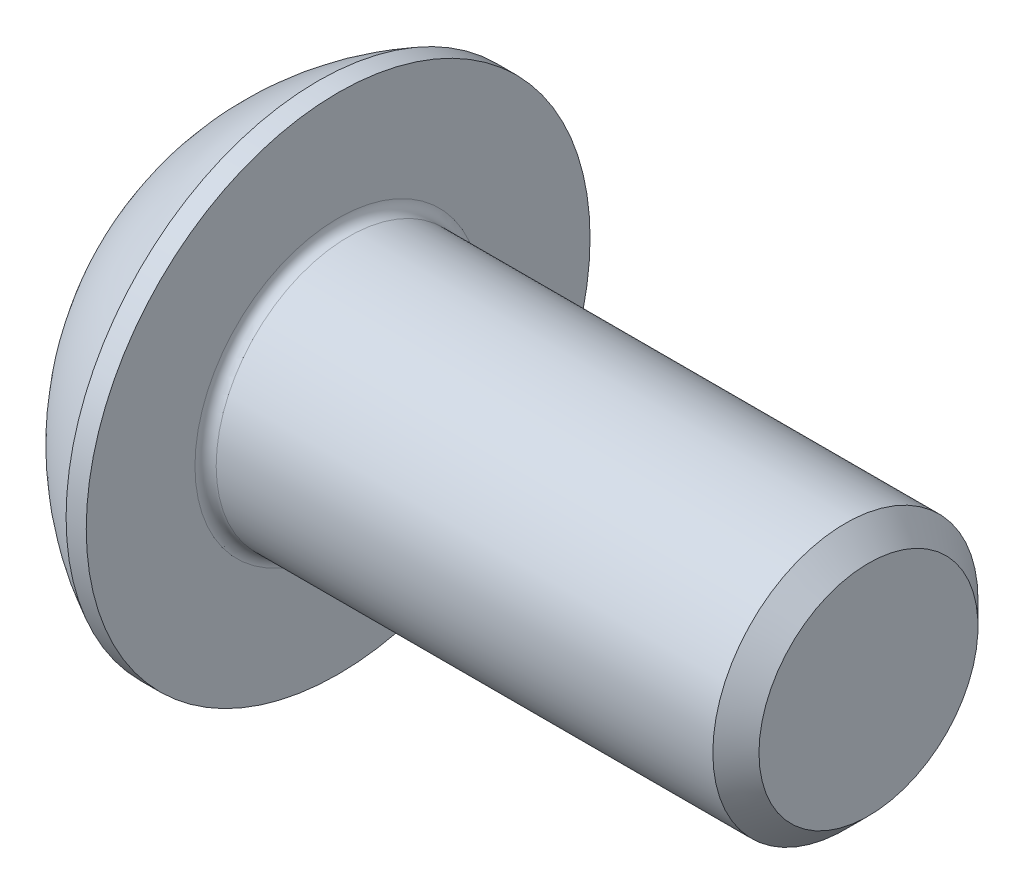
ISO-10303-21;
HEADER;
FILE_DESCRIPTION(('STEP AP214'),'2;1');
FILE_NAME('part.step','',(''),(''),'','','');
FILE_SCHEMA(('AUTOMOTIVE_DESIGN { 1 0 10303 214 1 1 1 1 }'));
ENDSEC;
DATA;
#1=APPLICATION_CONTEXT('core data for automotive mechanical design processes');
#2=APPLICATION_PROTOCOL_DEFINITION('international standard','automotive_design',2000,#1);
#3=PRODUCT_CONTEXT('',#1,'mechanical');
#4=PRODUCT('Part','Part','',(#3));
#5=PRODUCT_RELATED_PRODUCT_CATEGORY('part','',(#4));
#6=PRODUCT_DEFINITION_FORMATION('','',#4);
#7=PRODUCT_DEFINITION_CONTEXT('part definition',#1,'design');
#8=PRODUCT_DEFINITION('design','',#6,#7);
#9=PRODUCT_DEFINITION_SHAPE('','',#8);
#10=(LENGTH_UNIT() NAMED_UNIT(*) SI_UNIT(.MILLI.,.METRE.));
#11=(NAMED_UNIT(*) PLANE_ANGLE_UNIT() SI_UNIT($,.RADIAN.));
#12=(NAMED_UNIT(*) SI_UNIT($,.STERADIAN.) SOLID_ANGLE_UNIT());
#13=UNCERTAINTY_MEASURE_WITH_UNIT(LENGTH_MEASURE(1.E-05),#10,'distance_accuracy_value','');
#14=(GEOMETRIC_REPRESENTATION_CONTEXT(3) GLOBAL_UNCERTAINTY_ASSIGNED_CONTEXT((#13)) GLOBAL_UNIT_ASSIGNED_CONTEXT((#10,
#11,#12)) REPRESENTATION_CONTEXT('',''));
#15=CARTESIAN_POINT('',(0.,0.,0.));
#16=DIRECTION('',(0.,0.,1.));
#17=DIRECTION('',(1.,0.,0.));
#18=AXIS2_PLACEMENT_3D('',#15,#16,#17);
#19=CARTESIAN_POINT('',(0.,0.,0.));
#20=DIRECTION('',(-1.,0.,0.));
#21=DIRECTION('',(0.,0.,1.));
#22=AXIS2_PLACEMENT_3D('',#19,#20,#21);
#23=PLANE('',#22);
#24=CARTESIAN_POINT('',(0.,0.,0.));
#25=DIRECTION('',(-1.,0.,0.));
#26=DIRECTION('',(0.,0.,1.));
#27=AXIS2_PLACEMENT_3D('',#24,#25,#26);
#28=CIRCLE('',#27,2.375);
#29=CARTESIAN_POINT('',(0.,0.,2.375));
#30=VERTEX_POINT('',#29);
#31=EDGE_CURVE('E128',#30,#30,#28,.T.);
#32=ORIENTED_EDGE('',*,*,#31,.T.);
#33=EDGE_LOOP('',(#32));
#34=FACE_BOUND('',#33,.T.);
#35=DIRECTION('',(0.,-1.,0.));
#36=VECTOR('',#35,1.);
#37=CARTESIAN_POINT('',(0.,-0.866025403784438,1.5));
#38=LINE('',#37,#36);
#39=CARTESIAN_POINT('',(0.,0.866025403784439,1.5));
#40=VERTEX_POINT('',#39);
#41=CARTESIAN_POINT('',(0.,-0.866025403784438,1.5));
#42=VERTEX_POINT('',#41);
#43=EDGE_CURVE('E104',#40,#42,#38,.T.);
#44=ORIENTED_EDGE('',*,*,#43,.T.);
#45=DIRECTION('',(0.,-0.5,-0.866025403784439));
#46=VECTOR('',#45,1.);
#47=CARTESIAN_POINT('',(0.,-1.73205080756888,0.));
#48=LINE('',#47,#46);
#49=CARTESIAN_POINT('',(0.,-1.73205080756888,0.));
#50=VERTEX_POINT('',#49);
#51=EDGE_CURVE('E50',#42,#50,#48,.T.);
#52=ORIENTED_EDGE('',*,*,#51,.T.);
#53=DIRECTION('',(0.,0.5,-0.866025403784439));
#54=VECTOR('',#53,1.);
#55=CARTESIAN_POINT('',(0.,-0.866025403784438,-1.5));
#56=LINE('',#55,#54);
#57=CARTESIAN_POINT('',(0.,-0.866025403784438,-1.5));
#58=VERTEX_POINT('',#57);
#59=EDGE_CURVE('E108',#50,#58,#56,.T.);
#60=ORIENTED_EDGE('',*,*,#59,.T.);
#61=DIRECTION('',(0.,1.,0.));
#62=VECTOR('',#61,1.);
#63=CARTESIAN_POINT('',(0.,0.866025403784439,-1.5));
#64=LINE('',#63,#62);
#65=CARTESIAN_POINT('',(0.,0.866025403784439,-1.5));
#66=VERTEX_POINT('',#65);
#67=EDGE_CURVE('E305',#58,#66,#64,.T.);
#68=ORIENTED_EDGE('',*,*,#67,.T.);
#69=DIRECTION('',(0.,0.5,0.866025403784439));
#70=VECTOR('',#69,1.);
#71=CARTESIAN_POINT('',(0.,1.73205080756888,0.));
#72=LINE('',#71,#70);
#73=CARTESIAN_POINT('',(0.,1.73205080756888,0.));
#74=VERTEX_POINT('',#73);
#75=EDGE_CURVE('E302',#66,#74,#72,.T.);
#76=ORIENTED_EDGE('',*,*,#75,.T.);
#77=DIRECTION('',(0.,-0.5,0.866025403784439));
#78=VECTOR('',#77,1.);
#79=CARTESIAN_POINT('',(0.,0.866025403784439,1.5));
#80=LINE('',#79,#78);
#81=EDGE_CURVE('E296',#74,#40,#80,.T.);
#82=ORIENTED_EDGE('',*,*,#81,.T.);
#83=EDGE_LOOP('',(#44,#52,#60,#68,#76,#82));
#84=FACE_BOUND('',#83,.T.);
#85=ADVANCED_FACE('F34',(#34,#84),#23,.T.);
#86=CARTESIAN_POINT('',(4.75501582278481,0.,0.));
#87=DIRECTION('',(-1.,0.,0.));
#88=DIRECTION('',(0.,1.,0.));
#89=AXIS2_PLACEMENT_3D('',#86,#87,#88);
#90=SPHERICAL_SURFACE('',#89,5.3151482081814);
#91=CARTESIAN_POINT('',(2.37,0.,0.));
#92=DIRECTION('',(-1.,0.,0.));
#93=DIRECTION('',(0.,0.,1.));
#94=AXIS2_PLACEMENT_3D('',#91,#92,#93);
#95=CIRCLE('',#94,4.75);
#96=CARTESIAN_POINT('',(2.37,0.,4.75));
#97=VERTEX_POINT('',#96);
#98=EDGE_CURVE('E125',#97,#97,#95,.T.);
#99=ORIENTED_EDGE('',*,*,#98,.T.);
#100=EDGE_LOOP('',(#99));
#101=FACE_BOUND('',#100,.T.);
#102=ORIENTED_EDGE('',*,*,#31,.F.);
#103=EDGE_LOOP('',(#102));
#104=FACE_BOUND('',#103,.T.);
#105=ADVANCED_FACE('F150',(#101,#104),#90,.T.);
#106=CARTESIAN_POINT('',(0.,0.,0.));
#107=DIRECTION('',(-1.,0.,0.));
#108=DIRECTION('',(0.,0.,1.));
#109=AXIS2_PLACEMENT_3D('',#106,#107,#108);
#110=CYLINDRICAL_SURFACE('',#109,4.75);
#111=ORIENTED_EDGE('',*,*,#98,.F.);
#112=EDGE_LOOP('',(#111));
#113=FACE_BOUND('',#112,.T.);
#114=CARTESIAN_POINT('',(2.75,0.,0.));
#115=DIRECTION('',(-1.,0.,0.));
#116=DIRECTION('',(0.,0.,1.));
#117=AXIS2_PLACEMENT_3D('',#114,#115,#116);
#118=CIRCLE('',#117,4.75);
#119=CARTESIAN_POINT('',(2.75,0.,4.75));
#120=VERTEX_POINT('',#119);
#121=EDGE_CURVE('E122',#120,#120,#118,.T.);
#122=ORIENTED_EDGE('',*,*,#121,.T.);
#123=EDGE_LOOP('',(#122));
#124=FACE_BOUND('',#123,.T.);
#125=ADVANCED_FACE('F155',(#113,#124),#110,.T.);
#126=CARTESIAN_POINT('',(2.75,2.5,0.));
#127=DIRECTION('',(-1.,0.,0.));
#128=DIRECTION('',(0.,0.,1.));
#129=AXIS2_PLACEMENT_3D('',#126,#127,#128);
#130=PLANE('',#129);
#131=CARTESIAN_POINT('',(2.75,0.,0.));
#132=DIRECTION('',(-1.,0.,0.));
#133=DIRECTION('',(0.,0.,1.));
#134=AXIS2_PLACEMENT_3D('',#131,#132,#133);
#135=CIRCLE('',#134,2.7);
#136=CARTESIAN_POINT('',(2.75,0.,2.7));
#137=VERTEX_POINT('',#136);
#138=EDGE_CURVE('E43',#137,#137,#135,.T.);
#139=ORIENTED_EDGE('',*,*,#138,.T.);
#140=EDGE_LOOP('',(#139));
#141=FACE_BOUND('',#140,.T.);
#142=ORIENTED_EDGE('',*,*,#121,.F.);
#143=EDGE_LOOP('',(#142));
#144=FACE_BOUND('',#143,.T.);
#145=ADVANCED_FACE('F134',(#141,#144),#130,.F.);
#146=CARTESIAN_POINT('',(0.,0.,0.));
#147=DIRECTION('',(-1.,0.,0.));
#148=DIRECTION('',(0.,0.,1.));
#149=AXIS2_PLACEMENT_3D('',#146,#147,#148);
#150=CYLINDRICAL_SURFACE('',#149,2.5);
#151=CARTESIAN_POINT('',(2.95,0.,0.));
#152=DIRECTION('',(-1.,0.,0.));
#153=DIRECTION('',(0.,0.,1.));
#154=AXIS2_PLACEMENT_3D('',#151,#152,#153);
#155=CIRCLE('',#154,2.5);
#156=CARTESIAN_POINT('',(2.95,0.,2.5));
#157=VERTEX_POINT('',#156);
#158=EDGE_CURVE('E11',#157,#157,#155,.F.);
#159=ORIENTED_EDGE('',*,*,#158,.T.);
#160=EDGE_LOOP('',(#159));
#161=FACE_BOUND('',#160,.T.);
#162=CARTESIAN_POINT('',(12.315,0.,0.));
#163=DIRECTION('',(-1.,0.,0.));
#164=DIRECTION('',(0.,0.,1.));
#165=AXIS2_PLACEMENT_3D('',#162,#163,#164);
#166=CIRCLE('',#165,2.5);
#167=CARTESIAN_POINT('',(12.315,0.,2.5));
#168=VERTEX_POINT('',#167);
#169=EDGE_CURVE('E119',#168,#168,#166,.T.);
#170=ORIENTED_EDGE('',*,*,#169,.T.);
#171=EDGE_LOOP('',(#170));
#172=FACE_BOUND('',#171,.T.);
#173=ADVANCED_FACE('F165',(#161,#172),#150,.T.);
#174=CARTESIAN_POINT('',(12.75,0.,0.));
#175=DIRECTION('',(-1.,0.,0.));
#176=DIRECTION('',(0.,0.,1.));
#177=AXIS2_PLACEMENT_3D('',#174,#175,#176);
#178=CONICAL_SURFACE('',#177,2.065,0.785398163397443);
#179=ORIENTED_EDGE('',*,*,#169,.F.);
#180=EDGE_LOOP('',(#179));
#181=FACE_BOUND('',#180,.T.);
#182=CARTESIAN_POINT('',(12.75,0.,0.));
#183=DIRECTION('',(-1.,0.,0.));
#184=DIRECTION('',(0.,0.,1.));
#185=AXIS2_PLACEMENT_3D('',#182,#183,#184);
#186=CIRCLE('',#185,2.065);
#187=CARTESIAN_POINT('',(12.75,0.,2.065));
#188=VERTEX_POINT('',#187);
#189=EDGE_CURVE('E112',#188,#188,#186,.T.);
#190=ORIENTED_EDGE('',*,*,#189,.T.);
#191=EDGE_LOOP('',(#190));
#192=FACE_BOUND('',#191,.T.);
#193=ADVANCED_FACE('F145',(#181,#192),#178,.T.);
#194=CARTESIAN_POINT('',(12.75,0.,0.));
#195=DIRECTION('',(-1.,0.,0.));
#196=DIRECTION('',(0.,0.,1.));
#197=AXIS2_PLACEMENT_3D('',#194,#195,#196);
#198=PLANE('',#197);
#199=ORIENTED_EDGE('',*,*,#189,.F.);
#200=EDGE_LOOP('',(#199));
#201=FACE_BOUND('',#200,.T.);
#202=ADVANCED_FACE('F138',(#201),#198,.F.);
#203=CARTESIAN_POINT('',(2.95,0.,0.));
#204=DIRECTION('',(-1.,0.,0.));
#205=DIRECTION('',(0.,0.,1.));
#206=AXIS2_PLACEMENT_3D('',#203,#204,#205);
#207=TOROIDAL_SURFACE('',#206,2.7,0.2);
#208=ORIENTED_EDGE('',*,*,#158,.F.);
#209=EDGE_LOOP('',(#208));
#210=FACE_BOUND('',#209,.T.);
#211=ORIENTED_EDGE('',*,*,#138,.F.);
#212=EDGE_LOOP('',(#211));
#213=FACE_BOUND('',#212,.T.);
#214=ADVANCED_FACE('F36',(#210,#213),#207,.F.);
#215=CARTESIAN_POINT('',(1.5,-1.73205080756888,0.));
#216=DIRECTION('',(0.,0.866025403784439,-0.5));
#217=DIRECTION('',(0.,0.5,0.866025403784439));
#218=AXIS2_PLACEMENT_3D('',#215,#216,#217);
#219=PLANE('',#218);
#220=ORIENTED_EDGE('',*,*,#51,.F.);
#221=DIRECTION('',(-1.,0.,0.));
#222=VECTOR('',#221,1.);
#223=CARTESIAN_POINT('',(1.5,-0.866025403784438,1.5));
#224=LINE('',#223,#222);
#225=CARTESIAN_POINT('',(1.5,-0.866025403784438,1.5));
#226=VERTEX_POINT('',#225);
#227=EDGE_CURVE('E103',#226,#42,#224,.T.);
#228=ORIENTED_EDGE('',*,*,#227,.F.);
#229=DIRECTION('',(0.,-0.5,-0.866025403784439));
#230=VECTOR('',#229,1.);
#231=CARTESIAN_POINT('',(1.5,-1.73205080756888,0.));
#232=LINE('',#231,#230);
#233=CARTESIAN_POINT('',(1.5,-1.73205080756888,0.));
#234=VERTEX_POINT('',#233);
#235=EDGE_CURVE('E94',#226,#234,#232,.T.);
#236=ORIENTED_EDGE('',*,*,#235,.T.);
#237=DIRECTION('',(-1.,0.,0.));
#238=VECTOR('',#237,1.);
#239=CARTESIAN_POINT('',(1.5,-1.73205080756888,0.));
#240=LINE('',#239,#238);
#241=EDGE_CURVE('E102',#234,#50,#240,.T.);
#242=ORIENTED_EDGE('',*,*,#241,.T.);
#243=EDGE_LOOP('',(#220,#228,#236,#242));
#244=FACE_BOUND('',#243,.T.);
#245=ADVANCED_FACE('F101',(#244),#219,.T.);
#246=CARTESIAN_POINT('',(1.5,-0.866025403784438,-1.5));
#247=DIRECTION('',(0.,0.866025403784438,0.5));
#248=DIRECTION('',(0.,-0.5,0.866025403784439));
#249=AXIS2_PLACEMENT_3D('',#246,#247,#248);
#250=PLANE('',#249);
#251=ORIENTED_EDGE('',*,*,#59,.F.);
#252=ORIENTED_EDGE('',*,*,#241,.F.);
#253=DIRECTION('',(0.,0.5,-0.866025403784439));
#254=VECTOR('',#253,1.);
#255=CARTESIAN_POINT('',(1.5,-0.866025403784438,-1.5));
#256=LINE('',#255,#254);
#257=CARTESIAN_POINT('',(1.5,-0.866025403784438,-1.5));
#258=VERTEX_POINT('',#257);
#259=EDGE_CURVE('E90',#234,#258,#256,.T.);
#260=ORIENTED_EDGE('',*,*,#259,.T.);
#261=DIRECTION('',(-1.,0.,0.));
#262=VECTOR('',#261,1.);
#263=CARTESIAN_POINT('',(1.5,-0.866025403784438,-1.5));
#264=LINE('',#263,#262);
#265=EDGE_CURVE('E109',#258,#58,#264,.T.);
#266=ORIENTED_EDGE('',*,*,#265,.T.);
#267=EDGE_LOOP('',(#251,#252,#260,#266));
#268=FACE_BOUND('',#267,.T.);
#269=ADVANCED_FACE('F106',(#268),#250,.T.);
#270=CARTESIAN_POINT('',(1.5,0.866025403784439,-1.5));
#271=DIRECTION('',(0.,0.,1.));
#272=DIRECTION('',(1.,0.,0.));
#273=AXIS2_PLACEMENT_3D('',#270,#271,#272);
#274=PLANE('',#273);
#275=ORIENTED_EDGE('',*,*,#67,.F.);
#276=ORIENTED_EDGE('',*,*,#265,.F.);
#277=DIRECTION('',(0.,1.,0.));
#278=VECTOR('',#277,1.);
#279=CARTESIAN_POINT('',(1.5,0.866025403784439,-1.5));
#280=LINE('',#279,#278);
#281=CARTESIAN_POINT('',(1.5,0.866025403784439,-1.5));
#282=VERTEX_POINT('',#281);
#283=EDGE_CURVE('E96',#258,#282,#280,.T.);
#284=ORIENTED_EDGE('',*,*,#283,.T.);
#285=DIRECTION('',(-1.,0.,0.));
#286=VECTOR('',#285,1.);
#287=CARTESIAN_POINT('',(1.5,0.866025403784439,-1.5));
#288=LINE('',#287,#286);
#289=EDGE_CURVE('E113',#282,#66,#288,.T.);
#290=ORIENTED_EDGE('',*,*,#289,.T.);
#291=EDGE_LOOP('',(#275,#276,#284,#290));
#292=FACE_BOUND('',#291,.T.);
#293=ADVANCED_FACE('F178',(#292),#274,.T.);
#294=CARTESIAN_POINT('',(1.5,1.73205080756888,0.));
#295=DIRECTION('',(0.,-0.866025403784439,0.5));
#296=DIRECTION('',(0.,-0.5,-0.866025403784439));
#297=AXIS2_PLACEMENT_3D('',#294,#295,#296);
#298=PLANE('',#297);
#299=ORIENTED_EDGE('',*,*,#75,.F.);
#300=ORIENTED_EDGE('',*,*,#289,.F.);
#301=DIRECTION('',(0.,0.5,0.866025403784439));
#302=VECTOR('',#301,1.);
#303=CARTESIAN_POINT('',(1.5,1.73205080756888,0.));
#304=LINE('',#303,#302);
#305=CARTESIAN_POINT('',(1.5,1.73205080756888,0.));
#306=VERTEX_POINT('',#305);
#307=EDGE_CURVE('E321',#282,#306,#304,.T.);
#308=ORIENTED_EDGE('',*,*,#307,.T.);
#309=DIRECTION('',(-1.,0.,0.));
#310=VECTOR('',#309,1.);
#311=CARTESIAN_POINT('',(1.5,1.73205080756888,0.));
#312=LINE('',#311,#310);
#313=EDGE_CURVE('E312',#306,#74,#312,.T.);
#314=ORIENTED_EDGE('',*,*,#313,.T.);
#315=EDGE_LOOP('',(#299,#300,#308,#314));
#316=FACE_BOUND('',#315,.T.);
#317=ADVANCED_FACE('F181',(#316),#298,.T.);
#318=CARTESIAN_POINT('',(1.5,0.866025403784439,1.5));
#319=DIRECTION('',(0.,-0.866025403784439,-0.5));
#320=DIRECTION('',(0.,0.5,-0.866025403784439));
#321=AXIS2_PLACEMENT_3D('',#318,#319,#320);
#322=PLANE('',#321);
#323=ORIENTED_EDGE('',*,*,#81,.F.);
#324=ORIENTED_EDGE('',*,*,#313,.F.);
#325=DIRECTION('',(0.,-0.5,0.866025403784439));
#326=VECTOR('',#325,1.);
#327=CARTESIAN_POINT('',(1.5,0.866025403784439,1.5));
#328=LINE('',#327,#326);
#329=CARTESIAN_POINT('',(1.5,0.866025403784439,1.5));
#330=VERTEX_POINT('',#329);
#331=EDGE_CURVE('E319',#306,#330,#328,.T.);
#332=ORIENTED_EDGE('',*,*,#331,.T.);
#333=DIRECTION('',(-1.,0.,0.));
#334=VECTOR('',#333,1.);
#335=CARTESIAN_POINT('',(1.5,0.866025403784439,1.5));
#336=LINE('',#335,#334);
#337=EDGE_CURVE('E295',#330,#40,#336,.T.);
#338=ORIENTED_EDGE('',*,*,#337,.T.);
#339=EDGE_LOOP('',(#323,#324,#332,#338));
#340=FACE_BOUND('',#339,.T.);
#341=ADVANCED_FACE('F185',(#340),#322,.T.);
#342=CARTESIAN_POINT('',(1.5,-0.866025403784438,1.5));
#343=DIRECTION('',(0.,0.,-1.));
#344=DIRECTION('',(-1.,0.,0.));
#345=AXIS2_PLACEMENT_3D('',#342,#343,#344);
#346=PLANE('',#345);
#347=ORIENTED_EDGE('',*,*,#43,.F.);
#348=ORIENTED_EDGE('',*,*,#337,.F.);
#349=DIRECTION('',(0.,-1.,0.));
#350=VECTOR('',#349,1.);
#351=CARTESIAN_POINT('',(1.5,-0.866025403784438,1.5));
#352=LINE('',#351,#350);
#353=EDGE_CURVE('E310',#330,#226,#352,.T.);
#354=ORIENTED_EDGE('',*,*,#353,.T.);
#355=ORIENTED_EDGE('',*,*,#227,.T.);
#356=EDGE_LOOP('',(#347,#348,#354,#355));
#357=FACE_BOUND('',#356,.T.);
#358=ADVANCED_FACE('F189',(#357),#346,.T.);
#359=CARTESIAN_POINT('',(1.5,-1.73205080756888,0.));
#360=DIRECTION('',(1.,0.,0.));
#361=DIRECTION('',(0.,0.,-1.));
#362=AXIS2_PLACEMENT_3D('',#359,#360,#361);
#363=PLANE('',#362);
#364=CARTESIAN_POINT('',(1.5,0.,0.));
#365=DIRECTION('',(1.,0.,0.));
#366=DIRECTION('',(0.,0.,-1.));
#367=AXIS2_PLACEMENT_3D('',#364,#365,#366);
#368=CIRCLE('',#367,0.903589838486229);
#369=CARTESIAN_POINT('',(1.5,0.,-0.903589838486229));
#370=VERTEX_POINT('',#369);
#371=EDGE_CURVE('E38',#370,#370,#368,.T.);
#372=ORIENTED_EDGE('',*,*,#371,.T.);
#373=EDGE_LOOP('',(#372));
#374=FACE_BOUND('',#373,.T.);
#375=ORIENTED_EDGE('',*,*,#235,.F.);
#376=ORIENTED_EDGE('',*,*,#353,.F.);
#377=ORIENTED_EDGE('',*,*,#331,.F.);
#378=ORIENTED_EDGE('',*,*,#307,.F.);
#379=ORIENTED_EDGE('',*,*,#283,.F.);
#380=ORIENTED_EDGE('',*,*,#259,.F.);
#381=EDGE_LOOP('',(#375,#376,#377,#378,#379,#380));
#382=FACE_BOUND('',#381,.T.);
#383=ADVANCED_FACE('F92',(#374,#382),#363,.F.);
#384=CARTESIAN_POINT('',(2.02168783648704,0.,0.));
#385=DIRECTION('',(-1.,0.,0.));
#386=DIRECTION('',(0.,0.,1.));
#387=AXIS2_PLACEMENT_3D('',#384,#385,#386);
#388=CONICAL_SURFACE('',#387,0.,1.04719755119659);
#389=ORIENTED_EDGE('',*,*,#371,.F.);
#390=EDGE_LOOP('',(#389));
#391=FACE_BOUND('',#390,.T.);
#392=CARTESIAN_POINT('',(2.02168783648704,0.,0.));
#393=VERTEX_POINT('',#392);
#394=VERTEX_LOOP('',#393);
#395=FACE_BOUND('',#394,.T.);
#396=ADVANCED_FACE('F172',(#391,#395),#388,.F.);
#397=CLOSED_SHELL('',(#85,#105,#125,#145,#173,#193,#202,#214,#245,#269,#293,#317,#341,#358,#383,#396));
#398=MANIFOLD_SOLID_BREP('B2',#397);
#399=ADVANCED_BREP_SHAPE_REPRESENTATION('',(#18,#398),#14);
#400=SHAPE_DEFINITION_REPRESENTATION(#9,#399);
ENDSEC;
END-ISO-10303-21;
